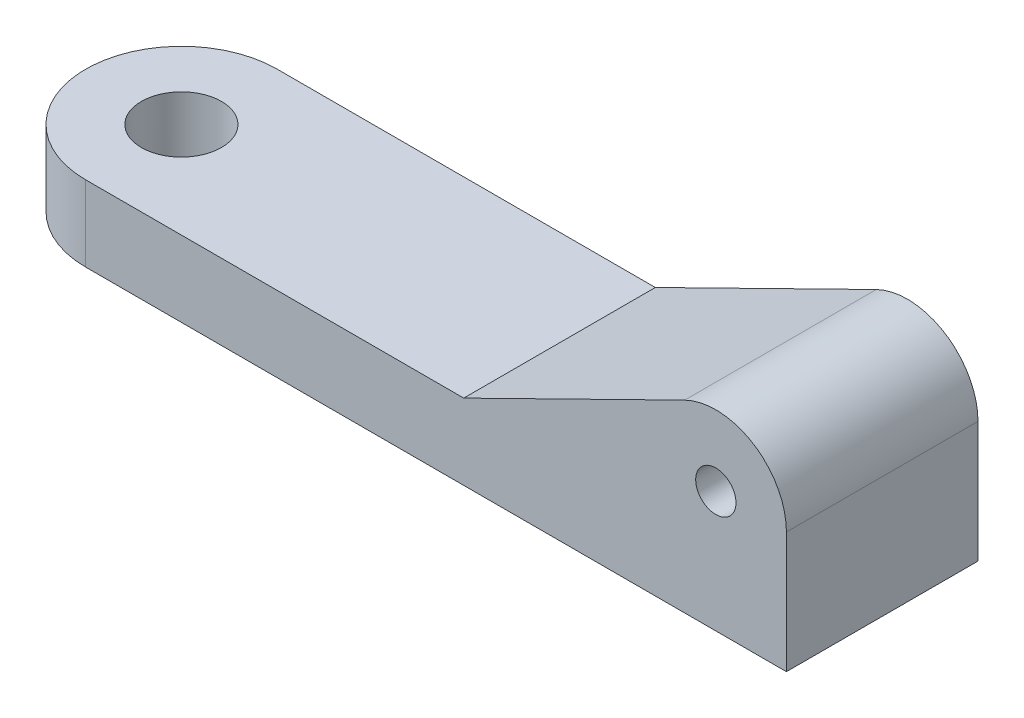
ISO-10303-21;
HEADER;
FILE_DESCRIPTION(('STEP AP214'),'2;1');
FILE_NAME('part.step','',(''),(''),'','','');
FILE_SCHEMA(('AUTOMOTIVE_DESIGN { 1 0 10303 214 1 1 1 1 }'));
ENDSEC;
DATA;
#1=APPLICATION_CONTEXT('core data for automotive mechanical design processes');
#2=APPLICATION_PROTOCOL_DEFINITION('international standard','automotive_design',2000,#1);
#3=PRODUCT_CONTEXT('',#1,'mechanical');
#4=PRODUCT('Part','Part','',(#3));
#5=PRODUCT_RELATED_PRODUCT_CATEGORY('part','',(#4));
#6=PRODUCT_DEFINITION_FORMATION('','',#4);
#7=PRODUCT_DEFINITION_CONTEXT('part definition',#1,'design');
#8=PRODUCT_DEFINITION('design','',#6,#7);
#9=PRODUCT_DEFINITION_SHAPE('','',#8);
#10=(LENGTH_UNIT() NAMED_UNIT(*) SI_UNIT(.MILLI.,.METRE.));
#11=(NAMED_UNIT(*) PLANE_ANGLE_UNIT() SI_UNIT($,.RADIAN.));
#12=(NAMED_UNIT(*) SI_UNIT($,.STERADIAN.) SOLID_ANGLE_UNIT());
#13=UNCERTAINTY_MEASURE_WITH_UNIT(LENGTH_MEASURE(1.E-05),#10,'distance_accuracy_value','');
#14=(GEOMETRIC_REPRESENTATION_CONTEXT(3) GLOBAL_UNCERTAINTY_ASSIGNED_CONTEXT((#13)) GLOBAL_UNIT_ASSIGNED_CONTEXT((#10,
#11,#12)) REPRESENTATION_CONTEXT('',''));
#15=CARTESIAN_POINT('',(0.,0.,0.));
#16=DIRECTION('',(0.,0.,1.));
#17=DIRECTION('',(1.,0.,0.));
#18=AXIS2_PLACEMENT_3D('',#15,#16,#17);
#19=CARTESIAN_POINT('',(0.,1.,0.));
#20=DIRECTION('',(0.,1.,0.));
#21=DIRECTION('',(0.,0.,1.));
#22=AXIS2_PLACEMENT_3D('',#19,#20,#21);
#23=PLANE('',#22);
#24=CARTESIAN_POINT('',(0.,1.,0.));
#25=DIRECTION('',(0.,1.,0.));
#26=DIRECTION('',(0.,0.,1.));
#27=AXIS2_PLACEMENT_3D('',#24,#25,#26);
#28=CIRCLE('',#27,7.6);
#29=CARTESIAN_POINT('',(0.,1.,-7.6));
#30=VERTEX_POINT('',#29);
#31=CARTESIAN_POINT('',(0.,1.,7.6));
#32=VERTEX_POINT('',#31);
#33=EDGE_CURVE('E228',#30,#32,#28,.T.);
#34=ORIENTED_EDGE('',*,*,#33,.T.);
#35=DIRECTION('',(1.,0.,0.));
#36=VECTOR('',#35,1.);
#37=CARTESIAN_POINT('',(30.,1.,7.6));
#38=LINE('',#37,#36);
#39=CARTESIAN_POINT('',(30.,1.,7.6));
#40=VERTEX_POINT('',#39);
#41=EDGE_CURVE('E231',#32,#40,#38,.T.);
#42=ORIENTED_EDGE('',*,*,#41,.T.);
#43=DIRECTION('',(0.,0.,-1.));
#44=VECTOR('',#43,1.);
#45=CARTESIAN_POINT('',(30.,1.,-7.6));
#46=LINE('',#45,#44);
#47=CARTESIAN_POINT('',(30.,1.,-7.6));
#48=VERTEX_POINT('',#47);
#49=EDGE_CURVE('E233',#40,#48,#46,.T.);
#50=ORIENTED_EDGE('',*,*,#49,.T.);
#51=DIRECTION('',(-1.,0.,0.));
#52=VECTOR('',#51,1.);
#53=CARTESIAN_POINT('',(0.,1.,-7.6));
#54=LINE('',#53,#52);
#55=EDGE_CURVE('E235',#48,#30,#54,.T.);
#56=ORIENTED_EDGE('',*,*,#55,.T.);
#57=EDGE_LOOP('',(#34,#42,#50,#56));
#58=FACE_BOUND('',#57,.T.);
#59=CARTESIAN_POINT('',(0.,1.,0.));
#60=DIRECTION('',(0.,1.,0.));
#61=DIRECTION('',(0.,0.,1.));
#62=AXIS2_PLACEMENT_3D('',#59,#60,#61);
#63=CIRCLE('',#62,3.175);
#64=CARTESIAN_POINT('',(0.,1.,3.175));
#65=VERTEX_POINT('',#64);
#66=EDGE_CURVE('E225',#65,#65,#63,.T.);
#67=ORIENTED_EDGE('',*,*,#66,.F.);
#68=EDGE_LOOP('',(#67));
#69=FACE_BOUND('',#68,.T.);
#70=ADVANCED_FACE('F30',(#58,#69),#23,.T.);
#71=CARTESIAN_POINT('',(0.,1.,0.));
#72=DIRECTION('',(0.,-1.,0.));
#73=DIRECTION('',(0.,0.,-1.));
#74=AXIS2_PLACEMENT_3D('',#71,#72,#73);
#75=CYLINDRICAL_SURFACE('',#74,7.6);
#76=DIRECTION('',(0.,-1.,0.));
#77=VECTOR('',#76,1.);
#78=CARTESIAN_POINT('',(0.,1.,-7.6));
#79=LINE('',#78,#77);
#80=CARTESIAN_POINT('',(0.,-5.,-7.6));
#81=VERTEX_POINT('',#80);
#82=EDGE_CURVE('E38',#30,#81,#79,.T.);
#83=ORIENTED_EDGE('',*,*,#82,.T.);
#84=CARTESIAN_POINT('',(0.,-5.,0.));
#85=DIRECTION('',(0.,-1.,0.));
#86=DIRECTION('',(0.,0.,-1.));
#87=AXIS2_PLACEMENT_3D('',#84,#85,#86);
#88=CIRCLE('',#87,7.6);
#89=CARTESIAN_POINT('',(0.,-5.,7.6));
#90=VERTEX_POINT('',#89);
#91=EDGE_CURVE('E144',#90,#81,#88,.T.);
#92=ORIENTED_EDGE('',*,*,#91,.F.);
#93=DIRECTION('',(0.,-1.,0.));
#94=VECTOR('',#93,1.);
#95=CARTESIAN_POINT('',(0.,1.,7.6));
#96=LINE('',#95,#94);
#97=EDGE_CURVE('E11',#32,#90,#96,.T.);
#98=ORIENTED_EDGE('',*,*,#97,.F.);
#99=ORIENTED_EDGE('',*,*,#33,.F.);
#100=EDGE_LOOP('',(#83,#92,#98,#99));
#101=FACE_BOUND('',#100,.T.);
#102=ADVANCED_FACE('F32',(#101),#75,.T.);
#103=CARTESIAN_POINT('',(30.,1.,7.6));
#104=DIRECTION('',(0.,0.,-1.));
#105=DIRECTION('',(-1.,0.,0.));
#106=AXIS2_PLACEMENT_3D('',#103,#104,#105);
#107=PLANE('',#106);
#108=ORIENTED_EDGE('',*,*,#97,.T.);
#109=DIRECTION('',(-1.,0.,0.));
#110=VECTOR('',#109,1.);
#111=CARTESIAN_POINT('',(0.,-5.,7.6));
#112=LINE('',#111,#110);
#113=CARTESIAN_POINT('',(55.6,-5.,7.6));
#114=VERTEX_POINT('',#113);
#115=EDGE_CURVE('E183',#114,#90,#112,.T.);
#116=ORIENTED_EDGE('',*,*,#115,.F.);
#117=DIRECTION('',(0.,-1.,0.));
#118=VECTOR('',#117,1.);
#119=CARTESIAN_POINT('',(55.6,500000.,7.6));
#120=LINE('',#119,#118);
#121=CARTESIAN_POINT('',(55.6,4.6,7.6));
#122=VERTEX_POINT('',#121);
#123=EDGE_CURVE('E190',#122,#114,#120,.T.);
#124=ORIENTED_EDGE('',*,*,#123,.F.);
#125=CARTESIAN_POINT('',(50.,4.6,7.6));
#126=DIRECTION('',(0.,0.,1.));
#127=DIRECTION('',(1.,0.,0.));
#128=AXIS2_PLACEMENT_3D('',#125,#126,#127);
#129=CIRCLE('',#128,5.6);
#130=CARTESIAN_POINT('',(47.5275638612436,9.62464521531335,7.6));
#131=VERTEX_POINT('',#130);
#132=EDGE_CURVE('E210',#122,#131,#129,.T.);
#133=ORIENTED_EDGE('',*,*,#132,.T.);
#134=DIRECTION('',(-0.897258074163098,-0.441506453349358,0.));
#135=VECTOR('',#134,1.);
#136=CARTESIAN_POINT('',(30.,1.,7.6));
#137=LINE('',#136,#135);
#138=EDGE_CURVE('E212',#131,#40,#137,.T.);
#139=ORIENTED_EDGE('',*,*,#138,.T.);
#140=ORIENTED_EDGE('',*,*,#41,.F.);
#141=EDGE_LOOP('',(#108,#116,#124,#133,#139,#140));
#142=FACE_BOUND('',#141,.T.);
#143=CARTESIAN_POINT('',(50.,4.6,7.6));
#144=DIRECTION('',(0.,0.,1.));
#145=DIRECTION('',(1.,0.,0.));
#146=AXIS2_PLACEMENT_3D('',#143,#144,#145);
#147=CIRCLE('',#146,1.6);
#148=CARTESIAN_POINT('',(48.4,4.6,7.6));
#149=VERTEX_POINT('',#148);
#150=EDGE_CURVE('E204',#149,#149,#147,.T.);
#151=ORIENTED_EDGE('',*,*,#150,.F.);
#152=EDGE_LOOP('',(#151));
#153=FACE_BOUND('',#152,.T.);
#154=ADVANCED_FACE('F252',(#142,#153),#107,.F.);
#155=CARTESIAN_POINT('',(0.,1.,-7.6));
#156=DIRECTION('',(0.,0.,1.));
#157=DIRECTION('',(1.,0.,0.));
#158=AXIS2_PLACEMENT_3D('',#155,#156,#157);
#159=PLANE('',#158);
#160=DIRECTION('',(1.,0.,0.));
#161=VECTOR('',#160,1.);
#162=CARTESIAN_POINT('',(55.6,-5.,-7.59999999999999));
#163=LINE('',#162,#161);
#164=CARTESIAN_POINT('',(55.6,-5.,-7.59999999999999));
#165=VERTEX_POINT('',#164);
#166=EDGE_CURVE('E177',#81,#165,#163,.T.);
#167=ORIENTED_EDGE('',*,*,#166,.F.);
#168=ORIENTED_EDGE('',*,*,#82,.F.);
#169=ORIENTED_EDGE('',*,*,#55,.F.);
#170=DIRECTION('',(-0.897258074163098,-0.441506453349358,0.));
#171=VECTOR('',#170,1.);
#172=CARTESIAN_POINT('',(30.,1.,-7.6));
#173=LINE('',#172,#171);
#174=CARTESIAN_POINT('',(47.5275638612436,9.62464521531335,-7.6));
#175=VERTEX_POINT('',#174);
#176=EDGE_CURVE('E213',#175,#48,#173,.T.);
#177=ORIENTED_EDGE('',*,*,#176,.F.);
#178=CARTESIAN_POINT('',(50.,4.6,-7.6));
#179=DIRECTION('',(0.,0.,1.));
#180=DIRECTION('',(1.,0.,0.));
#181=AXIS2_PLACEMENT_3D('',#178,#179,#180);
#182=CIRCLE('',#181,5.6);
#183=CARTESIAN_POINT('',(55.6,4.60000000009586,-7.59999999999999));
#184=VERTEX_POINT('',#183);
#185=EDGE_CURVE('E207',#184,#175,#182,.T.);
#186=ORIENTED_EDGE('',*,*,#185,.F.);
#187=DIRECTION('',(0.,-1.,0.));
#188=VECTOR('',#187,1.);
#189=CARTESIAN_POINT('',(55.6,500000.,-7.59999999999999));
#190=LINE('',#189,#188);
#191=EDGE_CURVE('E191',#184,#165,#190,.T.);
#192=ORIENTED_EDGE('',*,*,#191,.T.);
#193=EDGE_LOOP('',(#167,#168,#169,#177,#186,#192));
#194=FACE_BOUND('',#193,.T.);
#195=CARTESIAN_POINT('',(50.,4.6,-7.6));
#196=DIRECTION('',(0.,0.,1.));
#197=DIRECTION('',(1.,0.,0.));
#198=AXIS2_PLACEMENT_3D('',#195,#196,#197);
#199=CIRCLE('',#198,1.6);
#200=CARTESIAN_POINT('',(48.4,4.6,-7.6));
#201=VERTEX_POINT('',#200);
#202=EDGE_CURVE('E197',#201,#201,#199,.T.);
#203=ORIENTED_EDGE('',*,*,#202,.T.);
#204=EDGE_LOOP('',(#203));
#205=FACE_BOUND('',#204,.T.);
#206=ADVANCED_FACE('F244',(#194,#205),#159,.F.);
#207=CARTESIAN_POINT('',(0.,1.,0.));
#208=DIRECTION('',(0.,-1.,0.));
#209=DIRECTION('',(0.,0.,-1.));
#210=AXIS2_PLACEMENT_3D('',#207,#208,#209);
#211=CYLINDRICAL_SURFACE('',#210,3.175);
#212=ORIENTED_EDGE('',*,*,#66,.T.);
#213=EDGE_LOOP('',(#212));
#214=FACE_BOUND('',#213,.T.);
#215=CARTESIAN_POINT('',(0.,-5.,0.));
#216=DIRECTION('',(0.,-1.,0.));
#217=DIRECTION('',(0.,0.,-1.));
#218=AXIS2_PLACEMENT_3D('',#215,#216,#217);
#219=CIRCLE('',#218,3.175);
#220=CARTESIAN_POINT('',(0.,-5.,-3.175));
#221=VERTEX_POINT('',#220);
#222=EDGE_CURVE('E164',#221,#221,#219,.T.);
#223=ORIENTED_EDGE('',*,*,#222,.T.);
#224=EDGE_LOOP('',(#223));
#225=FACE_BOUND('',#224,.T.);
#226=ADVANCED_FACE('F286',(#214,#225),#211,.F.);
#227=CARTESIAN_POINT('',(50.,4.6,7.6));
#228=DIRECTION('',(0.,0.,-1.));
#229=DIRECTION('',(-1.,0.,0.));
#230=AXIS2_PLACEMENT_3D('',#227,#228,#229);
#231=CYLINDRICAL_SURFACE('',#230,5.6);
#232=ORIENTED_EDGE('',*,*,#132,.F.);
#233=DIRECTION('',(0.,0.,-1.));
#234=VECTOR('',#233,1.);
#235=CARTESIAN_POINT('',(55.6,4.6,7.6));
#236=LINE('',#235,#234);
#237=EDGE_CURVE('E193',#184,#122,#236,.F.);
#238=ORIENTED_EDGE('',*,*,#237,.F.);
#239=ORIENTED_EDGE('',*,*,#185,.T.);
#240=DIRECTION('',(0.,0.,-1.));
#241=VECTOR('',#240,1.);
#242=CARTESIAN_POINT('',(47.5275638612436,9.62464521531335,7.6));
#243=LINE('',#242,#241);
#244=EDGE_CURVE('E216',#131,#175,#243,.T.);
#245=ORIENTED_EDGE('',*,*,#244,.F.);
#246=EDGE_LOOP('',(#232,#238,#239,#245));
#247=FACE_BOUND('',#246,.T.);
#248=ADVANCED_FACE('F263',(#247),#231,.T.);
#249=CARTESIAN_POINT('',(30.,1.,7.6));
#250=DIRECTION('',(0.441506453349358,-0.897258074163098,0.));
#251=DIRECTION('',(0.897258074163098,0.441506453349358,0.));
#252=AXIS2_PLACEMENT_3D('',#249,#250,#251);
#253=PLANE('',#252);
#254=ORIENTED_EDGE('',*,*,#176,.T.);
#255=ORIENTED_EDGE('',*,*,#49,.F.);
#256=ORIENTED_EDGE('',*,*,#138,.F.);
#257=ORIENTED_EDGE('',*,*,#244,.T.);
#258=EDGE_LOOP('',(#254,#255,#256,#257));
#259=FACE_BOUND('',#258,.T.);
#260=ADVANCED_FACE('F260',(#259),#253,.F.);
#261=CARTESIAN_POINT('',(50.,4.6,7.6));
#262=DIRECTION('',(0.,0.,-1.));
#263=DIRECTION('',(-1.,0.,0.));
#264=AXIS2_PLACEMENT_3D('',#261,#262,#263);
#265=CYLINDRICAL_SURFACE('',#264,1.6);
#266=CARTESIAN_POINT('',(48.4,4.6,7.6));
#267=CARTESIAN_POINT('',(48.4,4.6,7.44166666666667));
#268=CARTESIAN_POINT('',(48.4,4.6,7.28333333333333));
#269=CARTESIAN_POINT('',(48.4,4.6,6.96666666666667));
#270=CARTESIAN_POINT('',(48.4,4.6,6.80833333333333));
#271=CARTESIAN_POINT('',(48.4,4.6,6.49166666666667));
#272=CARTESIAN_POINT('',(48.4,4.6,6.33333333333333));
#273=CARTESIAN_POINT('',(48.4,4.6,6.01666666666667));
#274=CARTESIAN_POINT('',(48.4,4.6,5.85833333333333));
#275=CARTESIAN_POINT('',(48.4,4.6,5.54166666666667));
#276=CARTESIAN_POINT('',(48.4,4.6,5.38333333333333));
#277=CARTESIAN_POINT('',(48.4,4.6,5.06666666666667));
#278=CARTESIAN_POINT('',(48.4,4.6,4.90833333333333));
#279=CARTESIAN_POINT('',(48.4,4.6,4.59166666666667));
#280=CARTESIAN_POINT('',(48.4,4.6,4.43333333333333));
#281=CARTESIAN_POINT('',(48.4,4.6,4.11666666666667));
#282=CARTESIAN_POINT('',(48.4,4.6,3.95833333333333));
#283=CARTESIAN_POINT('',(48.4,4.6,3.64166666666667));
#284=CARTESIAN_POINT('',(48.4,4.6,3.48333333333333));
#285=CARTESIAN_POINT('',(48.4,4.6,3.16666666666667));
#286=CARTESIAN_POINT('',(48.4,4.6,3.00833333333333));
#287=CARTESIAN_POINT('',(48.4,4.6,2.69166666666667));
#288=CARTESIAN_POINT('',(48.4,4.6,2.53333333333333));
#289=CARTESIAN_POINT('',(48.4,4.6,2.21666666666667));
#290=CARTESIAN_POINT('',(48.4,4.6,2.05833333333333));
#291=CARTESIAN_POINT('',(48.4,4.6,1.74166666666667));
#292=CARTESIAN_POINT('',(48.4,4.6,1.58333333333333));
#293=CARTESIAN_POINT('',(48.4,4.6,1.26666666666667));
#294=CARTESIAN_POINT('',(48.4,4.6,1.10833333333333));
#295=CARTESIAN_POINT('',(48.4,4.6,0.791666666666666));
#296=CARTESIAN_POINT('',(48.4,4.6,0.633333333333332));
#297=CARTESIAN_POINT('',(48.4,4.6,0.316666666666666));
#298=CARTESIAN_POINT('',(48.4,4.6,0.158333333333332));
#299=CARTESIAN_POINT('',(48.4,4.6,-0.158333333333334));
#300=CARTESIAN_POINT('',(48.4,4.6,-0.316666666666666));
#301=CARTESIAN_POINT('',(48.4,4.6,-0.633333333333332));
#302=CARTESIAN_POINT('',(48.4,4.6,-0.791666666666665));
#303=CARTESIAN_POINT('',(48.4,4.6,-1.10833333333333));
#304=CARTESIAN_POINT('',(48.4,4.6,-1.26666666666667));
#305=CARTESIAN_POINT('',(48.4,4.6,-1.58333333333333));
#306=CARTESIAN_POINT('',(48.4,4.6,-1.74166666666667));
#307=CARTESIAN_POINT('',(48.4,4.6,-2.05833333333333));
#308=CARTESIAN_POINT('',(48.4,4.6,-2.21666666666667));
#309=CARTESIAN_POINT('',(48.4,4.6,-2.53333333333333));
#310=CARTESIAN_POINT('',(48.4,4.6,-2.69166666666667));
#311=CARTESIAN_POINT('',(48.4,4.6,-3.00833333333333));
#312=CARTESIAN_POINT('',(48.4,4.6,-3.16666666666667));
#313=CARTESIAN_POINT('',(48.4,4.6,-3.48333333333333));
#314=CARTESIAN_POINT('',(48.4,4.6,-3.64166666666667));
#315=CARTESIAN_POINT('',(48.4,4.6,-3.95833333333333));
#316=CARTESIAN_POINT('',(48.4,4.6,-4.11666666666667));
#317=CARTESIAN_POINT('',(48.4,4.6,-4.43333333333333));
#318=CARTESIAN_POINT('',(48.4,4.6,-4.59166666666667));
#319=CARTESIAN_POINT('',(48.4,4.6,-4.90833333333333));
#320=CARTESIAN_POINT('',(48.4,4.6,-5.06666666666667));
#321=CARTESIAN_POINT('',(48.4,4.6,-5.38333333333333));
#322=CARTESIAN_POINT('',(48.4,4.6,-5.54166666666667));
#323=CARTESIAN_POINT('',(48.4,4.6,-5.85833333333333));
#324=CARTESIAN_POINT('',(48.4,4.6,-6.01666666666667));
#325=CARTESIAN_POINT('',(48.4,4.6,-6.33333333333333));
#326=CARTESIAN_POINT('',(48.4,4.6,-6.49166666666667));
#327=CARTESIAN_POINT('',(48.4,4.6,-6.80833333333333));
#328=CARTESIAN_POINT('',(48.4,4.6,-6.96666666666667));
#329=CARTESIAN_POINT('',(48.4,4.6,-7.28333333333333));
#330=CARTESIAN_POINT('',(48.4,4.6,-7.44166666666667));
#331=CARTESIAN_POINT('',(48.4,4.6,-7.6));
#332=B_SPLINE_CURVE_WITH_KNOTS('',3,(#266,#267,#268,#269,#270,#271,#272,#273,#274,#275,#276,
#277,#278,#279,#280,#281,#282,#283,#284,#285,#286,#287,#288,#289,#290,#291,#292,#293,#294,#295,
#296,#297,#298,#299,#300,#301,#302,#303,#304,#305,#306,#307,#308,#309,#310,#311,#312,#313,#314,
#315,#316,#317,#318,#319,#320,#321,#322,#323,#324,#325,#326,#327,#328,#329,#330,#331),
.UNSPECIFIED.,.F.,.F.,(4,2,2,2,2,2,2,2,2,2,2,2,2,2,2,2,2,2,2,2,2,2,2,2,2,2,2,2,2,2,2,2,4),(0.,
0.475,0.95,1.425,1.9,2.375,2.85,3.325,3.8,4.275,4.75,5.225,5.7,6.175,6.65,7.125,7.6,8.075,8.55,
9.025,9.5,9.975,10.45,10.925,11.4,11.875,12.35,12.825,13.3,13.775,14.25,14.725,15.2),.UNSPECIFIED.);
#333=EDGE_CURVE('BSEAM320',#149,#201,#332,.T.);
#334=ORIENTED_EDGE('',*,*,#150,.T.);
#335=ORIENTED_EDGE('',*,*,#202,.F.);
#336=ORIENTED_EDGE('',*,*,#333,.T.);
#337=ORIENTED_EDGE('',*,*,#333,.F.);
#338=EDGE_LOOP('',(#334,#336,#335,#337));
#339=FACE_BOUND('',#338,.T.);
#340=ADVANCED_FACE('F320',(#339),#265,.F.);
#341=CARTESIAN_POINT('',(54.1,500000.,-6.09999999999999));
#342=DIRECTION('',(0.,0.,-1.));
#343=DIRECTION('',(-1.,0.,0.));
#344=AXIS2_PLACEMENT_3D('',#341,#342,#343);
#345=PLANE('',#344);
#346=CARTESIAN_POINT('',(50.,4.6,-6.09999999999999));
#347=DIRECTION('',(0.,0.,-1.));
#348=DIRECTION('',(-1.,0.,0.));
#349=AXIS2_PLACEMENT_3D('',#346,#347,#348);
#350=CIRCLE('',#349,5.6);
#351=CARTESIAN_POINT('',(50.,-1.,-6.09999999999999));
#352=VERTEX_POINT('',#351);
#353=CARTESIAN_POINT('',(54.1,0.785553775447867,-6.09999999999999));
#354=VERTEX_POINT('',#353);
#355=EDGE_CURVE('E195',#352,#354,#350,.F.);
#356=ORIENTED_EDGE('',*,*,#355,.F.);
#357=DIRECTION('',(1.,0.,0.));
#358=VECTOR('',#357,1.);
#359=CARTESIAN_POINT('',(54.1,-1.,-6.09999999999999));
#360=LINE('',#359,#358);
#361=CARTESIAN_POINT('',(6.92459385090563,-1.,-6.09999999999999));
#362=VERTEX_POINT('',#361);
#363=EDGE_CURVE('E143',#362,#352,#360,.T.);
#364=ORIENTED_EDGE('',*,*,#363,.F.);
#365=DIRECTION('',(0.,1.,0.));
#366=VECTOR('',#365,1.);
#367=CARTESIAN_POINT('',(6.92459385090563,-5.,-6.09999999999999));
#368=LINE('',#367,#366);
#369=CARTESIAN_POINT('',(6.92459385090563,-5.,-6.09999999999999));
#370=VERTEX_POINT('',#369);
#371=EDGE_CURVE('E128',#370,#362,#368,.T.);
#372=ORIENTED_EDGE('',*,*,#371,.F.);
#373=DIRECTION('',(1.,0.,0.));
#374=VECTOR('',#373,1.);
#375=CARTESIAN_POINT('',(54.1,-5.,-6.09999999999999));
#376=LINE('',#375,#374);
#377=CARTESIAN_POINT('',(54.1,-5.,-6.09999999999999));
#378=VERTEX_POINT('',#377);
#379=EDGE_CURVE('E134',#370,#378,#376,.T.);
#380=ORIENTED_EDGE('',*,*,#379,.T.);
#381=DIRECTION('',(0.,-1.,0.));
#382=VECTOR('',#381,1.);
#383=CARTESIAN_POINT('',(54.1,500000.,-6.09999999999999));
#384=LINE('',#383,#382);
#385=EDGE_CURVE('E186',#354,#378,#384,.T.);
#386=ORIENTED_EDGE('',*,*,#385,.F.);
#387=EDGE_LOOP('',(#356,#364,#372,#380,#386));
#388=FACE_BOUND('',#387,.T.);
#389=ADVANCED_FACE('F140',(#388),#345,.F.);
#390=CARTESIAN_POINT('',(54.1,500000.,6.1));
#391=DIRECTION('',(1.,0.,0.));
#392=DIRECTION('',(0.,0.,-1.));
#393=AXIS2_PLACEMENT_3D('',#390,#391,#392);
#394=PLANE('',#393);
#395=DIRECTION('',(0.,0.,-1.));
#396=VECTOR('',#395,1.);
#397=CARTESIAN_POINT('',(54.1,0.785553775447867,7.6));
#398=LINE('',#397,#396);
#399=CARTESIAN_POINT('',(54.1,0.785553775585868,6.1));
#400=VERTEX_POINT('',#399);
#401=EDGE_CURVE('E198',#354,#400,#398,.F.);
#402=ORIENTED_EDGE('',*,*,#401,.F.);
#403=ORIENTED_EDGE('',*,*,#385,.T.);
#404=DIRECTION('',(0.,0.,1.));
#405=VECTOR('',#404,1.);
#406=CARTESIAN_POINT('',(54.1,-5.,6.1));
#407=LINE('',#406,#405);
#408=CARTESIAN_POINT('',(54.1,-5.,6.1));
#409=VERTEX_POINT('',#408);
#410=EDGE_CURVE('E151',#378,#409,#407,.T.);
#411=ORIENTED_EDGE('',*,*,#410,.T.);
#412=DIRECTION('',(0.,-1.,0.));
#413=VECTOR('',#412,1.);
#414=CARTESIAN_POINT('',(54.1,500000.,6.1));
#415=LINE('',#414,#413);
#416=EDGE_CURVE('E188',#400,#409,#415,.T.);
#417=ORIENTED_EDGE('',*,*,#416,.F.);
#418=EDGE_LOOP('',(#402,#403,#411,#417));
#419=FACE_BOUND('',#418,.T.);
#420=ADVANCED_FACE('F275',(#419),#394,.F.);
#421=CARTESIAN_POINT('',(6.92459385090563,500000.,6.1));
#422=DIRECTION('',(0.,0.,1.));
#423=DIRECTION('',(1.,0.,0.));
#424=AXIS2_PLACEMENT_3D('',#421,#422,#423);
#425=PLANE('',#424);
#426=CARTESIAN_POINT('',(50.,4.6,6.1));
#427=DIRECTION('',(0.,0.,1.));
#428=DIRECTION('',(1.,0.,0.));
#429=AXIS2_PLACEMENT_3D('',#426,#427,#428);
#430=CIRCLE('',#429,5.6);
#431=CARTESIAN_POINT('',(50.,-1.,6.1));
#432=VERTEX_POINT('',#431);
#433=EDGE_CURVE('E199',#400,#432,#430,.F.);
#434=ORIENTED_EDGE('',*,*,#433,.F.);
#435=ORIENTED_EDGE('',*,*,#416,.T.);
#436=DIRECTION('',(-1.,0.,0.));
#437=VECTOR('',#436,1.);
#438=CARTESIAN_POINT('',(6.92459385090563,-5.,6.1));
#439=LINE('',#438,#437);
#440=CARTESIAN_POINT('',(6.92459385090563,-5.,6.1));
#441=VERTEX_POINT('',#440);
#442=EDGE_CURVE('E153',#409,#441,#439,.T.);
#443=ORIENTED_EDGE('',*,*,#442,.T.);
#444=DIRECTION('',(0.,1.,0.));
#445=VECTOR('',#444,1.);
#446=CARTESIAN_POINT('',(6.92459385090563,-5.,6.1));
#447=LINE('',#446,#445);
#448=CARTESIAN_POINT('',(6.92459385090563,-1.,6.1));
#449=VERTEX_POINT('',#448);
#450=EDGE_CURVE('E145',#441,#449,#447,.T.);
#451=ORIENTED_EDGE('',*,*,#450,.T.);
#452=DIRECTION('',(-1.,0.,0.));
#453=VECTOR('',#452,1.);
#454=CARTESIAN_POINT('',(6.92459385090563,-1.,6.1));
#455=LINE('',#454,#453);
#456=EDGE_CURVE('E52',#432,#449,#455,.T.);
#457=ORIENTED_EDGE('',*,*,#456,.F.);
#458=EDGE_LOOP('',(#434,#435,#443,#451,#457));
#459=FACE_BOUND('',#458,.T.);
#460=ADVANCED_FACE('F268',(#459),#425,.F.);
#461=CARTESIAN_POINT('',(55.6,500000.,7.6));
#462=DIRECTION('',(1.,0.,0.));
#463=DIRECTION('',(0.,0.,-1.));
#464=AXIS2_PLACEMENT_3D('',#461,#462,#463);
#465=PLANE('',#464);
#466=ORIENTED_EDGE('',*,*,#191,.F.);
#467=ORIENTED_EDGE('',*,*,#237,.T.);
#468=ORIENTED_EDGE('',*,*,#123,.T.);
#469=DIRECTION('',(0.,0.,1.));
#470=VECTOR('',#469,1.);
#471=CARTESIAN_POINT('',(55.6,-5.,7.6));
#472=LINE('',#471,#470);
#473=EDGE_CURVE('E180',#165,#114,#472,.T.);
#474=ORIENTED_EDGE('',*,*,#473,.F.);
#475=EDGE_LOOP('',(#466,#467,#468,#474));
#476=FACE_BOUND('',#475,.T.);
#477=ADVANCED_FACE('F266',(#476),#465,.T.);
#478=CARTESIAN_POINT('',(0.,-5.,0.));
#479=DIRECTION('',(0.,-1.,0.));
#480=DIRECTION('',(0.,0.,-1.));
#481=AXIS2_PLACEMENT_3D('',#478,#479,#480);
#482=PLANE('',#481);
#483=ORIENTED_EDGE('',*,*,#379,.F.);
#484=CARTESIAN_POINT('',(6.92459385090563,-5.,-5.09999999999999));
#485=DIRECTION('',(0.,-1.,0.));
#486=DIRECTION('',(0.,0.,1.));
#487=AXIS2_PLACEMENT_3D('',#484,#485,#486);
#488=CIRCLE('',#487,1.);
#489=CARTESIAN_POINT('',(6.11940851940498,-5.,-4.50697674418604));
#490=VERTEX_POINT('',#489);
#491=EDGE_CURVE('E125',#490,#370,#488,.T.);
#492=ORIENTED_EDGE('',*,*,#491,.F.);
#493=CARTESIAN_POINT('',(0.,-5.,0.));
#494=DIRECTION('',(0.,1.,0.));
#495=DIRECTION('',(0.,0.,-1.));
#496=AXIS2_PLACEMENT_3D('',#493,#494,#495);
#497=CIRCLE('',#496,7.6);
#498=CARTESIAN_POINT('',(6.11940851940497,-5.,4.50697674418605));
#499=VERTEX_POINT('',#498);
#500=EDGE_CURVE('E161',#499,#490,#497,.T.);
#501=ORIENTED_EDGE('',*,*,#500,.F.);
#502=CARTESIAN_POINT('',(6.92459385090563,-5.,5.1));
#503=DIRECTION('',(0.,-1.,0.));
#504=DIRECTION('',(0.,0.,-1.));
#505=AXIS2_PLACEMENT_3D('',#502,#503,#504);
#506=CIRCLE('',#505,1.);
#507=EDGE_CURVE('E158',#441,#499,#506,.T.);
#508=ORIENTED_EDGE('',*,*,#507,.F.);
#509=ORIENTED_EDGE('',*,*,#442,.F.);
#510=ORIENTED_EDGE('',*,*,#410,.F.);
#511=EDGE_LOOP('',(#483,#492,#501,#508,#509,#510));
#512=FACE_BOUND('',#511,.T.);
#513=ORIENTED_EDGE('',*,*,#91,.T.);
#514=ORIENTED_EDGE('',*,*,#166,.T.);
#515=ORIENTED_EDGE('',*,*,#473,.T.);
#516=ORIENTED_EDGE('',*,*,#115,.T.);
#517=EDGE_LOOP('',(#513,#514,#515,#516));
#518=FACE_BOUND('',#517,.T.);
#519=ORIENTED_EDGE('',*,*,#222,.F.);
#520=EDGE_LOOP('',(#519));
#521=FACE_BOUND('',#520,.T.);
#522=ADVANCED_FACE('F147',(#512,#518,#521),#482,.T.);
#523=CARTESIAN_POINT('',(6.92459385090563,-5.,-5.09999999999999));
#524=DIRECTION('',(0.,1.,0.));
#525=DIRECTION('',(0.,0.,1.));
#526=AXIS2_PLACEMENT_3D('',#523,#524,#525);
#527=CYLINDRICAL_SURFACE('',#526,1.);
#528=CARTESIAN_POINT('',(6.92459385090563,-1.,-5.09999999999999));
#529=DIRECTION('',(0.,-1.,0.));
#530=DIRECTION('',(0.,0.,1.));
#531=AXIS2_PLACEMENT_3D('',#528,#529,#530);
#532=CIRCLE('',#531,1.);
#533=CARTESIAN_POINT('',(6.11940851940498,-1.,-4.50697674418604));
#534=VERTEX_POINT('',#533);
#535=EDGE_CURVE('E45',#534,#362,#532,.T.);
#536=ORIENTED_EDGE('',*,*,#535,.F.);
#537=DIRECTION('',(0.,1.,0.));
#538=VECTOR('',#537,1.);
#539=CARTESIAN_POINT('',(6.11940851940498,-5.,-4.50697674418604));
#540=LINE('',#539,#538);
#541=EDGE_CURVE('E130',#490,#534,#540,.T.);
#542=ORIENTED_EDGE('',*,*,#541,.F.);
#543=ORIENTED_EDGE('',*,*,#491,.T.);
#544=ORIENTED_EDGE('',*,*,#371,.T.);
#545=EDGE_LOOP('',(#536,#542,#543,#544));
#546=FACE_BOUND('',#545,.T.);
#547=ADVANCED_FACE('F127',(#546),#527,.F.);
#548=CARTESIAN_POINT('',(6.92459385090563,-5.,5.1));
#549=DIRECTION('',(0.,1.,0.));
#550=DIRECTION('',(0.,0.,1.));
#551=AXIS2_PLACEMENT_3D('',#548,#549,#550);
#552=CYLINDRICAL_SURFACE('',#551,1.);
#553=CARTESIAN_POINT('',(6.92459385090563,-1.,5.1));
#554=DIRECTION('',(0.,-1.,0.));
#555=DIRECTION('',(0.,0.,-1.));
#556=AXIS2_PLACEMENT_3D('',#553,#554,#555);
#557=CIRCLE('',#556,1.);
#558=CARTESIAN_POINT('',(6.11940851940497,-1.,4.50697674418605));
#559=VERTEX_POINT('',#558);
#560=EDGE_CURVE('E167',#449,#559,#557,.T.);
#561=ORIENTED_EDGE('',*,*,#560,.F.);
#562=ORIENTED_EDGE('',*,*,#450,.F.);
#563=ORIENTED_EDGE('',*,*,#507,.T.);
#564=DIRECTION('',(0.,1.,0.));
#565=VECTOR('',#564,1.);
#566=CARTESIAN_POINT('',(6.11940851940497,-5.,4.50697674418605));
#567=LINE('',#566,#565);
#568=EDGE_CURVE('E171',#499,#559,#567,.T.);
#569=ORIENTED_EDGE('',*,*,#568,.T.);
#570=EDGE_LOOP('',(#561,#562,#563,#569));
#571=FACE_BOUND('',#570,.T.);
#572=ADVANCED_FACE('F362',(#571),#552,.F.);
#573=CARTESIAN_POINT('',(0.,-5.,0.));
#574=DIRECTION('',(0.,1.,0.));
#575=DIRECTION('',(0.,0.,1.));
#576=AXIS2_PLACEMENT_3D('',#573,#574,#575);
#577=CYLINDRICAL_SURFACE('',#576,7.6);
#578=CARTESIAN_POINT('',(0.,-1.,0.));
#579=DIRECTION('',(0.,1.,0.));
#580=DIRECTION('',(0.,0.,-1.));
#581=AXIS2_PLACEMENT_3D('',#578,#579,#580);
#582=CIRCLE('',#581,7.6);
#583=EDGE_CURVE('E135',#559,#534,#582,.T.);
#584=ORIENTED_EDGE('',*,*,#583,.F.);
#585=ORIENTED_EDGE('',*,*,#568,.F.);
#586=ORIENTED_EDGE('',*,*,#500,.T.);
#587=ORIENTED_EDGE('',*,*,#541,.T.);
#588=EDGE_LOOP('',(#584,#585,#586,#587));
#589=FACE_BOUND('',#588,.T.);
#590=ADVANCED_FACE('F371',(#589),#577,.T.);
#591=ORIENTED_EDGE('',*,*,#355,.T.);
#592=ORIENTED_EDGE('',*,*,#401,.T.);
#593=ORIENTED_EDGE('',*,*,#433,.T.);
#594=DIRECTION('',(0.,0.,-1.));
#595=VECTOR('',#594,1.);
#596=CARTESIAN_POINT('',(50.,-1.,7.6));
#597=LINE('',#596,#595);
#598=EDGE_CURVE('E222',#432,#352,#597,.T.);
#599=ORIENTED_EDGE('',*,*,#598,.T.);
#600=EDGE_LOOP('',(#591,#592,#593,#599));
#601=FACE_BOUND('',#600,.T.);
#602=ADVANCED_FACE('F291',(#601),#231,.T.);
#603=CARTESIAN_POINT('',(0.,-1.,0.));
#604=DIRECTION('',(0.,1.,0.));
#605=DIRECTION('',(0.,0.,1.));
#606=AXIS2_PLACEMENT_3D('',#603,#604,#605);
#607=PLANE('',#606);
#608=ORIENTED_EDGE('',*,*,#363,.T.);
#609=ORIENTED_EDGE('',*,*,#598,.F.);
#610=ORIENTED_EDGE('',*,*,#456,.T.);
#611=ORIENTED_EDGE('',*,*,#560,.T.);
#612=ORIENTED_EDGE('',*,*,#583,.T.);
#613=ORIENTED_EDGE('',*,*,#535,.T.);
#614=EDGE_LOOP('',(#608,#609,#610,#611,#612,#613));
#615=FACE_BOUND('',#614,.T.);
#616=ADVANCED_FACE('F288',(#615),#607,.F.);
#617=CLOSED_SHELL('',(#70,#102,#154,#206,#226,#248,#260,#340,#389,#420,#460,#477,#522,#547,#572,
#590,#602,#616));
#618=MANIFOLD_SOLID_BREP('B2',#617);
#619=ADVANCED_BREP_SHAPE_REPRESENTATION('',(#18,#618),#14);
#620=SHAPE_DEFINITION_REPRESENTATION(#9,#619);
ENDSEC;
END-ISO-10303-21;
